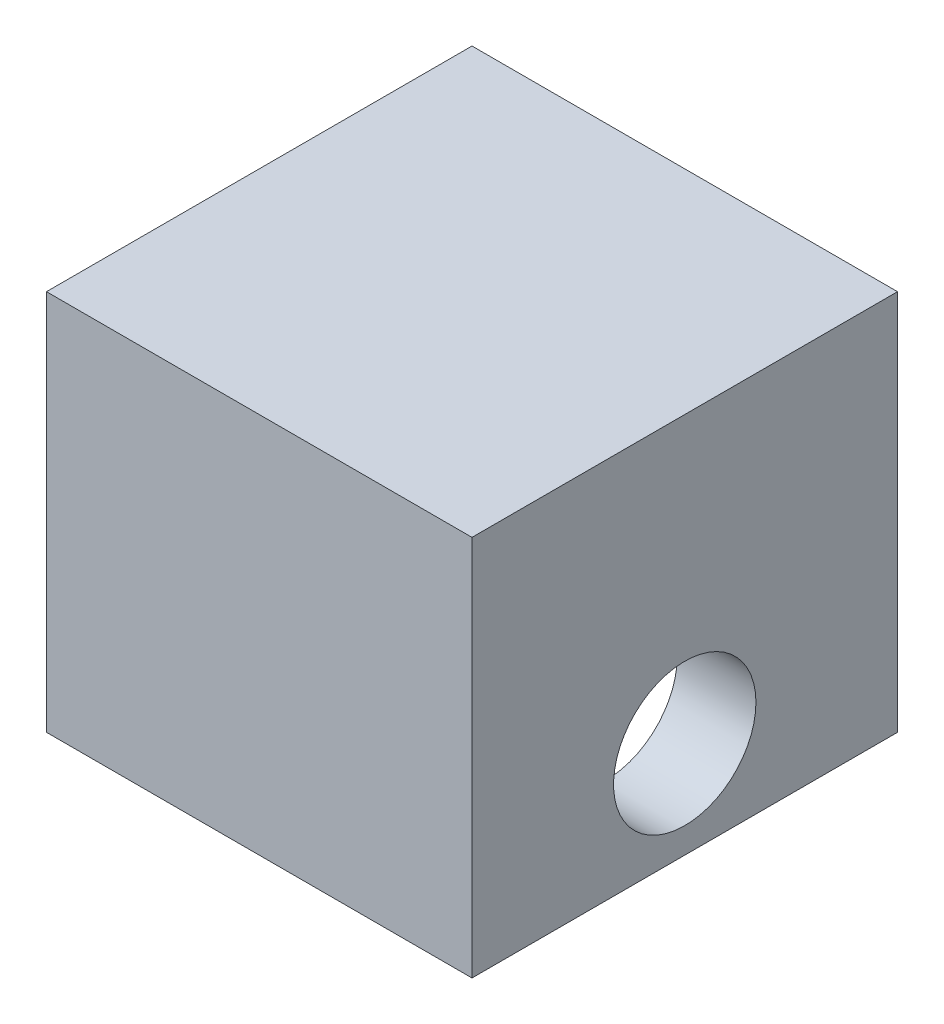
ISO-10303-21;
HEADER;
FILE_DESCRIPTION(('STEP AP214'),'2;1');
FILE_NAME('part.step','',(''),(''),'','','');
FILE_SCHEMA(('AUTOMOTIVE_DESIGN { 1 0 10303 214 1 1 1 1 }'));
ENDSEC;
DATA;
#1=APPLICATION_CONTEXT('core data for automotive mechanical design processes');
#2=APPLICATION_PROTOCOL_DEFINITION('international standard','automotive_design',2000,#1);
#3=PRODUCT_CONTEXT('',#1,'mechanical');
#4=PRODUCT('Part','Part','',(#3));
#5=PRODUCT_RELATED_PRODUCT_CATEGORY('part','',(#4));
#6=PRODUCT_DEFINITION_FORMATION('','',#4);
#7=PRODUCT_DEFINITION_CONTEXT('part definition',#1,'design');
#8=PRODUCT_DEFINITION('design','',#6,#7);
#9=PRODUCT_DEFINITION_SHAPE('','',#8);
#10=(LENGTH_UNIT() NAMED_UNIT(*) SI_UNIT(.MILLI.,.METRE.));
#11=(NAMED_UNIT(*) PLANE_ANGLE_UNIT() SI_UNIT($,.RADIAN.));
#12=(NAMED_UNIT(*) SI_UNIT($,.STERADIAN.) SOLID_ANGLE_UNIT());
#13=UNCERTAINTY_MEASURE_WITH_UNIT(LENGTH_MEASURE(1.E-05),#10,'distance_accuracy_value','');
#14=(GEOMETRIC_REPRESENTATION_CONTEXT(3) GLOBAL_UNCERTAINTY_ASSIGNED_CONTEXT((#13)) GLOBAL_UNIT_ASSIGNED_CONTEXT((#10,
#11,#12)) REPRESENTATION_CONTEXT('',''));
#15=CARTESIAN_POINT('',(0.,0.,0.));
#16=DIRECTION('',(0.,0.,1.));
#17=DIRECTION('',(1.,0.,0.));
#18=AXIS2_PLACEMENT_3D('',#15,#16,#17);
#19=CARTESIAN_POINT('',(0.,0.,10.795));
#20=DIRECTION('',(-1.,0.,0.));
#21=DIRECTION('',(0.,0.,1.));
#22=AXIS2_PLACEMENT_3D('',#19,#20,#21);
#23=PLANE('',#22);
#24=CARTESIAN_POINT('',(0.,3.58648,5.3975));
#25=DIRECTION('',(-1.,0.,0.));
#26=DIRECTION('',(0.,0.,1.));
#27=AXIS2_PLACEMENT_3D('',#24,#25,#26);
#28=CIRCLE('',#27,2.12471);
#29=CARTESIAN_POINT('',(0.,3.58648,7.52221));
#30=VERTEX_POINT('',#29);
#31=EDGE_CURVE('E165',#30,#30,#28,.T.);
#32=ORIENTED_EDGE('',*,*,#31,.T.);
#33=EDGE_LOOP('',(#32));
#34=FACE_BOUND('',#33,.T.);
#35=DIRECTION('',(0.,1.,0.));
#36=VECTOR('',#35,1.);
#37=CARTESIAN_POINT('',(0.,0.,10.795));
#38=LINE('',#37,#36);
#39=CARTESIAN_POINT('',(0.,0.6985,10.795));
#40=VERTEX_POINT('',#39);
#41=CARTESIAN_POINT('',(0.,10.08888,10.795));
#42=VERTEX_POINT('',#41);
#43=EDGE_CURVE('E169',#40,#42,#38,.T.);
#44=ORIENTED_EDGE('',*,*,#43,.F.);
#45=DIRECTION('',(0.,0.,-1.));
#46=VECTOR('',#45,1.);
#47=CARTESIAN_POINT('',(0.,0.6985,10.795));
#48=LINE('',#47,#46);
#49=CARTESIAN_POINT('',(0.,0.6985,0.));
#50=VERTEX_POINT('',#49);
#51=EDGE_CURVE('E153',#40,#50,#48,.T.);
#52=ORIENTED_EDGE('',*,*,#51,.T.);
#53=DIRECTION('',(0.,1.,0.));
#54=VECTOR('',#53,1.);
#55=CARTESIAN_POINT('',(0.,0.,0.));
#56=LINE('',#55,#54);
#57=CARTESIAN_POINT('',(0.,10.08888,0.));
#58=VERTEX_POINT('',#57);
#59=EDGE_CURVE('E168',#50,#58,#56,.T.);
#60=ORIENTED_EDGE('',*,*,#59,.T.);
#61=DIRECTION('',(0.,0.,-1.));
#62=VECTOR('',#61,1.);
#63=CARTESIAN_POINT('',(0.,10.08888,10.795));
#64=LINE('',#63,#62);
#65=EDGE_CURVE('E13',#42,#58,#64,.T.);
#66=ORIENTED_EDGE('',*,*,#65,.F.);
#67=EDGE_LOOP('',(#44,#52,#60,#66));
#68=FACE_BOUND('',#67,.T.);
#69=ADVANCED_FACE('F47',(#34,#68),#23,.F.);
#70=CARTESIAN_POINT('',(0.,10.08888,10.795));
#71=DIRECTION('',(0.,1.,0.));
#72=DIRECTION('',(0.,0.,1.));
#73=AXIS2_PLACEMENT_3D('',#70,#71,#72);
#74=PLANE('',#73);
#75=DIRECTION('',(1.,0.,0.));
#76=VECTOR('',#75,1.);
#77=CARTESIAN_POINT('',(0.,10.08888,0.));
#78=LINE('',#77,#76);
#79=CARTESIAN_POINT('',(8.001,10.08888,0.));
#80=VERTEX_POINT('',#79);
#81=EDGE_CURVE('E181',#58,#80,#78,.T.);
#82=ORIENTED_EDGE('',*,*,#81,.T.);
#83=DIRECTION('',(0.,0.,-1.));
#84=VECTOR('',#83,1.);
#85=CARTESIAN_POINT('',(8.001,10.08888,10.795));
#86=LINE('',#85,#84);
#87=CARTESIAN_POINT('',(8.001,10.08888,10.795));
#88=VERTEX_POINT('',#87);
#89=EDGE_CURVE('E55',#88,#80,#86,.T.);
#90=ORIENTED_EDGE('',*,*,#89,.F.);
#91=DIRECTION('',(1.,0.,0.));
#92=VECTOR('',#91,1.);
#93=CARTESIAN_POINT('',(0.,10.08888,10.795));
#94=LINE('',#93,#92);
#95=EDGE_CURVE('E172',#42,#88,#94,.T.);
#96=ORIENTED_EDGE('',*,*,#95,.F.);
#97=ORIENTED_EDGE('',*,*,#65,.T.);
#98=EDGE_LOOP('',(#82,#90,#96,#97));
#99=FACE_BOUND('',#98,.T.);
#100=ADVANCED_FACE('F194',(#99),#74,.F.);
#101=CARTESIAN_POINT('',(8.001,10.08888,10.795));
#102=DIRECTION('',(1.,0.,0.));
#103=DIRECTION('',(0.,0.,-1.));
#104=AXIS2_PLACEMENT_3D('',#101,#102,#103);
#105=PLANE('',#104);
#106=CARTESIAN_POINT('',(8.001,3.58648,5.3975));
#107=DIRECTION('',(1.,0.,0.));
#108=DIRECTION('',(0.,0.,-1.));
#109=AXIS2_PLACEMENT_3D('',#106,#107,#108);
#110=CIRCLE('',#109,2.12471);
#111=CARTESIAN_POINT('',(8.001,3.58648,3.27279));
#112=VERTEX_POINT('',#111);
#113=EDGE_CURVE('E160',#112,#112,#110,.T.);
#114=ORIENTED_EDGE('',*,*,#113,.T.);
#115=EDGE_LOOP('',(#114));
#116=FACE_BOUND('',#115,.T.);
#117=DIRECTION('',(0.,-1.,0.));
#118=VECTOR('',#117,1.);
#119=CARTESIAN_POINT('',(8.001,10.08888,0.));
#120=LINE('',#119,#118);
#121=CARTESIAN_POINT('',(8.001,0.6985,0.));
#122=VERTEX_POINT('',#121);
#123=EDGE_CURVE('E173',#80,#122,#120,.T.);
#124=ORIENTED_EDGE('',*,*,#123,.T.);
#125=DIRECTION('',(0.,0.,1.));
#126=VECTOR('',#125,1.);
#127=CARTESIAN_POINT('',(8.001,0.698499999999999,10.795));
#128=LINE('',#127,#126);
#129=CARTESIAN_POINT('',(8.001,0.6985,10.795));
#130=VERTEX_POINT('',#129);
#131=EDGE_CURVE('E118',#122,#130,#128,.T.);
#132=ORIENTED_EDGE('',*,*,#131,.T.);
#133=DIRECTION('',(0.,-1.,0.));
#134=VECTOR('',#133,1.);
#135=CARTESIAN_POINT('',(8.001,10.08888,10.795));
#136=LINE('',#135,#134);
#137=EDGE_CURVE('E176',#88,#130,#136,.T.);
#138=ORIENTED_EDGE('',*,*,#137,.F.);
#139=ORIENTED_EDGE('',*,*,#89,.T.);
#140=EDGE_LOOP('',(#124,#132,#138,#139));
#141=FACE_BOUND('',#140,.T.);
#142=ADVANCED_FACE('F188',(#116,#141),#105,.F.);
#143=CARTESIAN_POINT('',(10.3505,0.,10.795));
#144=DIRECTION('',(-1.,0.,0.));
#145=DIRECTION('',(0.,0.,1.));
#146=AXIS2_PLACEMENT_3D('',#143,#144,#145);
#147=PLANE('',#146);
#148=CARTESIAN_POINT('',(10.3505,3.58648,5.3975));
#149=DIRECTION('',(1.,0.,0.));
#150=DIRECTION('',(0.,0.,-1.));
#151=AXIS2_PLACEMENT_3D('',#148,#149,#150);
#152=CIRCLE('',#151,2.12471);
#153=CARTESIAN_POINT('',(10.3505,3.58648,3.27279));
#154=VERTEX_POINT('',#153);
#155=EDGE_CURVE('E156',#154,#154,#152,.T.);
#156=ORIENTED_EDGE('',*,*,#155,.F.);
#157=EDGE_LOOP('',(#156));
#158=FACE_BOUND('',#157,.T.);
#159=DIRECTION('',(0.,0.,-1.));
#160=VECTOR('',#159,1.);
#161=CARTESIAN_POINT('',(10.3505,12.08786,10.795));
#162=LINE('',#161,#160);
#163=CARTESIAN_POINT('',(10.3505,12.08786,11.7475));
#164=VERTEX_POINT('',#163);
#165=CARTESIAN_POINT('',(10.3505,12.08786,-0.952499999999999));
#166=VERTEX_POINT('',#165);
#167=EDGE_CURVE('E186',#164,#166,#162,.T.);
#168=ORIENTED_EDGE('',*,*,#167,.F.);
#169=DIRECTION('',(0.,-1.,0.));
#170=VECTOR('',#169,1.);
#171=CARTESIAN_POINT('',(10.3505,12.08786,11.7475));
#172=LINE('',#171,#170);
#173=CARTESIAN_POINT('',(10.3505,0.6985,11.7475));
#174=VERTEX_POINT('',#173);
#175=EDGE_CURVE('E138',#164,#174,#172,.T.);
#176=ORIENTED_EDGE('',*,*,#175,.T.);
#177=DIRECTION('',(0.,0.,1.));
#178=VECTOR('',#177,1.);
#179=CARTESIAN_POINT('',(10.3505,0.6985,10.795));
#180=LINE('',#179,#178);
#181=CARTESIAN_POINT('',(10.3505,0.6985,-0.9525));
#182=VERTEX_POINT('',#181);
#183=EDGE_CURVE('E119',#182,#174,#180,.T.);
#184=ORIENTED_EDGE('',*,*,#183,.F.);
#185=DIRECTION('',(0.,1.,0.));
#186=VECTOR('',#185,1.);
#187=CARTESIAN_POINT('',(10.3505,12.08786,-0.952499999999999));
#188=LINE('',#187,#186);
#189=EDGE_CURVE('E127',#182,#166,#188,.T.);
#190=ORIENTED_EDGE('',*,*,#189,.T.);
#191=EDGE_LOOP('',(#168,#176,#184,#190));
#192=FACE_BOUND('',#191,.T.);
#193=ADVANCED_FACE('F232',(#158,#192),#147,.F.);
#194=CARTESIAN_POINT('',(10.3505,12.08786,10.795));
#195=DIRECTION('',(0.,-1.,0.));
#196=DIRECTION('',(1.,0.,0.));
#197=AXIS2_PLACEMENT_3D('',#194,#195,#196);
#198=PLANE('',#197);
#199=ORIENTED_EDGE('',*,*,#167,.T.);
#200=DIRECTION('',(1.,0.,0.));
#201=VECTOR('',#200,1.);
#202=CARTESIAN_POINT('',(-2.3495,12.08786,-0.952499999999999));
#203=LINE('',#202,#201);
#204=CARTESIAN_POINT('',(-2.3495,12.08786,-0.952499999999999));
#205=VERTEX_POINT('',#204);
#206=EDGE_CURVE('E128',#205,#166,#203,.T.);
#207=ORIENTED_EDGE('',*,*,#206,.F.);
#208=DIRECTION('',(0.,0.,-1.));
#209=VECTOR('',#208,1.);
#210=CARTESIAN_POINT('',(-2.3495,12.08786,10.795));
#211=LINE('',#210,#209);
#212=CARTESIAN_POINT('',(-2.3495,12.08786,11.7475));
#213=VERTEX_POINT('',#212);
#214=EDGE_CURVE('E132',#213,#205,#211,.T.);
#215=ORIENTED_EDGE('',*,*,#214,.F.);
#216=DIRECTION('',(1.,0.,0.));
#217=VECTOR('',#216,1.);
#218=CARTESIAN_POINT('',(-2.3495,12.08786,11.7475));
#219=LINE('',#218,#217);
#220=EDGE_CURVE('E142',#213,#164,#219,.T.);
#221=ORIENTED_EDGE('',*,*,#220,.T.);
#222=EDGE_LOOP('',(#199,#207,#215,#221));
#223=FACE_BOUND('',#222,.T.);
#224=ADVANCED_FACE('F225',(#223),#198,.F.);
#225=CARTESIAN_POINT('',(-2.3495,12.08786,10.795));
#226=DIRECTION('',(1.,0.,0.));
#227=DIRECTION('',(0.,1.,0.));
#228=AXIS2_PLACEMENT_3D('',#225,#226,#227);
#229=PLANE('',#228);
#230=CARTESIAN_POINT('',(-2.3495,3.58648,5.3975));
#231=DIRECTION('',(1.,0.,0.));
#232=DIRECTION('',(0.,0.,-1.));
#233=AXIS2_PLACEMENT_3D('',#230,#231,#232);
#234=CIRCLE('',#233,2.12471);
#235=CARTESIAN_POINT('',(-2.3495,3.58648,3.27279));
#236=VERTEX_POINT('',#235);
#237=EDGE_CURVE('E157',#236,#236,#234,.T.);
#238=ORIENTED_EDGE('',*,*,#237,.T.);
#239=EDGE_LOOP('',(#238));
#240=FACE_BOUND('',#239,.T.);
#241=ORIENTED_EDGE('',*,*,#214,.T.);
#242=DIRECTION('',(0.,1.,0.));
#243=VECTOR('',#242,1.);
#244=CARTESIAN_POINT('',(-2.3495,12.08786,-0.952499999999999));
#245=LINE('',#244,#243);
#246=CARTESIAN_POINT('',(-2.3495,0.6985,-0.9525));
#247=VERTEX_POINT('',#246);
#248=EDGE_CURVE('E125',#247,#205,#245,.T.);
#249=ORIENTED_EDGE('',*,*,#248,.F.);
#250=DIRECTION('',(0.,0.,1.));
#251=VECTOR('',#250,1.);
#252=CARTESIAN_POINT('',(-2.3495,0.6985,10.795));
#253=LINE('',#252,#251);
#254=CARTESIAN_POINT('',(-2.3495,0.6985,11.7475));
#255=VERTEX_POINT('',#254);
#256=EDGE_CURVE('E107',#247,#255,#253,.T.);
#257=ORIENTED_EDGE('',*,*,#256,.T.);
#258=DIRECTION('',(0.,-1.,0.));
#259=VECTOR('',#258,1.);
#260=CARTESIAN_POINT('',(-2.3495,12.08786,11.7475));
#261=LINE('',#260,#259);
#262=EDGE_CURVE('E140',#213,#255,#261,.T.);
#263=ORIENTED_EDGE('',*,*,#262,.F.);
#264=EDGE_LOOP('',(#241,#249,#257,#263));
#265=FACE_BOUND('',#264,.T.);
#266=ADVANCED_FACE('F131',(#240,#265),#229,.F.);
#267=CARTESIAN_POINT('',(-2.3495,3.58648,5.3975));
#268=DIRECTION('',(1.,0.,0.));
#269=DIRECTION('',(0.,0.,-1.));
#270=AXIS2_PLACEMENT_3D('',#267,#268,#269);
#271=CYLINDRICAL_SURFACE('',#270,2.12471);
#272=ORIENTED_EDGE('',*,*,#237,.F.);
#273=EDGE_LOOP('',(#272));
#274=FACE_BOUND('',#273,.T.);
#275=ORIENTED_EDGE('',*,*,#31,.F.);
#276=EDGE_LOOP('',(#275));
#277=FACE_BOUND('',#276,.T.);
#278=ADVANCED_FACE('F210',(#274,#277),#271,.F.);
#279=ORIENTED_EDGE('',*,*,#155,.T.);
#280=EDGE_LOOP('',(#279));
#281=FACE_BOUND('',#280,.T.);
#282=ORIENTED_EDGE('',*,*,#113,.F.);
#283=EDGE_LOOP('',(#282));
#284=FACE_BOUND('',#283,.T.);
#285=ADVANCED_FACE('F202',(#281,#284),#271,.F.);
#286=CARTESIAN_POINT('',(-2.3495,0.6985,10.795));
#287=DIRECTION('',(0.,1.,0.));
#288=DIRECTION('',(0.,0.,1.));
#289=AXIS2_PLACEMENT_3D('',#286,#287,#288);
#290=PLANE('',#289);
#291=ORIENTED_EDGE('',*,*,#131,.F.);
#292=DIRECTION('',(1.,0.,0.));
#293=VECTOR('',#292,1.);
#294=CARTESIAN_POINT('',(-2.3495,0.6985,0.));
#295=LINE('',#294,#293);
#296=EDGE_CURVE('E129',#50,#122,#295,.T.);
#297=ORIENTED_EDGE('',*,*,#296,.F.);
#298=ORIENTED_EDGE('',*,*,#51,.F.);
#299=DIRECTION('',(1.,0.,0.));
#300=VECTOR('',#299,1.);
#301=CARTESIAN_POINT('',(-2.3495,0.6985,10.795));
#302=LINE('',#301,#300);
#303=EDGE_CURVE('E145',#40,#130,#302,.T.);
#304=ORIENTED_EDGE('',*,*,#303,.T.);
#305=EDGE_LOOP('',(#291,#297,#298,#304));
#306=FACE_BOUND('',#305,.T.);
#307=DIRECTION('',(1.,0.,0.));
#308=VECTOR('',#307,1.);
#309=CARTESIAN_POINT('',(-2.3495,0.6985,-0.9525));
#310=LINE('',#309,#308);
#311=EDGE_CURVE('E110',#247,#182,#310,.T.);
#312=ORIENTED_EDGE('',*,*,#311,.T.);
#313=ORIENTED_EDGE('',*,*,#183,.T.);
#314=DIRECTION('',(1.,0.,0.));
#315=VECTOR('',#314,1.);
#316=CARTESIAN_POINT('',(-2.3495,0.6985,11.7475));
#317=LINE('',#316,#315);
#318=EDGE_CURVE('E113',#255,#174,#317,.T.);
#319=ORIENTED_EDGE('',*,*,#318,.F.);
#320=ORIENTED_EDGE('',*,*,#256,.F.);
#321=EDGE_LOOP('',(#312,#313,#319,#320));
#322=FACE_BOUND('',#321,.T.);
#323=ADVANCED_FACE('F109',(#306,#322),#290,.F.);
#324=CARTESIAN_POINT('',(-2.3495,0.6985,10.795));
#325=DIRECTION('',(0.,0.,-1.));
#326=DIRECTION('',(-1.,0.,0.));
#327=AXIS2_PLACEMENT_3D('',#324,#325,#326);
#328=PLANE('',#327);
#329=ORIENTED_EDGE('',*,*,#303,.F.);
#330=ORIENTED_EDGE('',*,*,#43,.T.);
#331=ORIENTED_EDGE('',*,*,#95,.T.);
#332=ORIENTED_EDGE('',*,*,#137,.T.);
#333=EDGE_LOOP('',(#329,#330,#331,#332));
#334=FACE_BOUND('',#333,.T.);
#335=ADVANCED_FACE('F192',(#334),#328,.T.);
#336=CARTESIAN_POINT('',(-2.3495,12.08786,11.7475));
#337=DIRECTION('',(0.,0.,1.));
#338=DIRECTION('',(0.,-1.,0.));
#339=AXIS2_PLACEMENT_3D('',#336,#337,#338);
#340=PLANE('',#339);
#341=ORIENTED_EDGE('',*,*,#175,.F.);
#342=ORIENTED_EDGE('',*,*,#220,.F.);
#343=ORIENTED_EDGE('',*,*,#262,.T.);
#344=ORIENTED_EDGE('',*,*,#318,.T.);
#345=EDGE_LOOP('',(#341,#342,#343,#344));
#346=FACE_BOUND('',#345,.T.);
#347=ADVANCED_FACE('F208',(#346),#340,.T.);
#348=CARTESIAN_POINT('',(-2.3495,12.08786,0.));
#349=DIRECTION('',(0.,0.,1.));
#350=DIRECTION('',(1.,0.,0.));
#351=AXIS2_PLACEMENT_3D('',#348,#349,#350);
#352=PLANE('',#351);
#353=ORIENTED_EDGE('',*,*,#123,.F.);
#354=ORIENTED_EDGE('',*,*,#81,.F.);
#355=ORIENTED_EDGE('',*,*,#59,.F.);
#356=ORIENTED_EDGE('',*,*,#296,.T.);
#357=EDGE_LOOP('',(#353,#354,#355,#356));
#358=FACE_BOUND('',#357,.T.);
#359=ADVANCED_FACE('F199',(#358),#352,.T.);
#360=CARTESIAN_POINT('',(-2.3495,12.08786,-0.952499999999999));
#361=DIRECTION('',(0.,0.,-1.));
#362=DIRECTION('',(0.,1.,0.));
#363=AXIS2_PLACEMENT_3D('',#360,#361,#362);
#364=PLANE('',#363);
#365=ORIENTED_EDGE('',*,*,#189,.F.);
#366=ORIENTED_EDGE('',*,*,#311,.F.);
#367=ORIENTED_EDGE('',*,*,#248,.T.);
#368=ORIENTED_EDGE('',*,*,#206,.T.);
#369=EDGE_LOOP('',(#365,#366,#367,#368));
#370=FACE_BOUND('',#369,.T.);
#371=ADVANCED_FACE('F123',(#370),#364,.T.);
#372=CLOSED_SHELL('',(#69,#100,#142,#193,#224,#266,#278,#285,#323,#335,#347,#359,#371));
#373=MANIFOLD_SOLID_BREP('B2',#372);
#374=ADVANCED_BREP_SHAPE_REPRESENTATION('',(#18,#373),#14);
#375=SHAPE_DEFINITION_REPRESENTATION(#9,#374);
ENDSEC;
END-ISO-10303-21;
